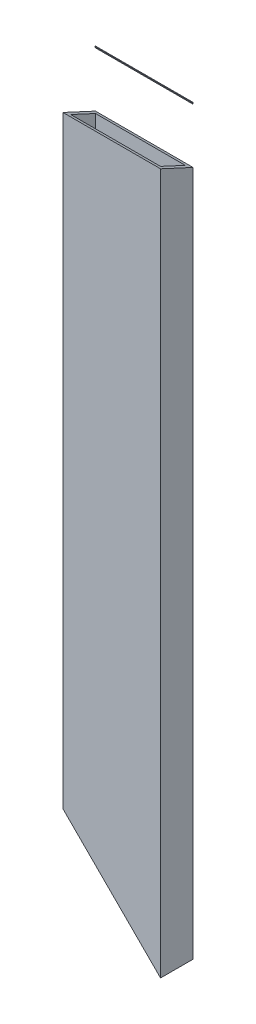
ISO-10303-21;
HEADER;
FILE_DESCRIPTION(('STEP AP214'),'2;1');
FILE_NAME('part.step','',(''),(''),'','','');
FILE_SCHEMA(('AUTOMOTIVE_DESIGN { 1 0 10303 214 1 1 1 1 }'));
ENDSEC;
DATA;
#1=APPLICATION_CONTEXT('core data for automotive mechanical design processes');
#2=APPLICATION_PROTOCOL_DEFINITION('international standard','automotive_design',2000,#1);
#3=PRODUCT_CONTEXT('',#1,'mechanical');
#4=PRODUCT('Part','Part','',(#3));
#5=PRODUCT_RELATED_PRODUCT_CATEGORY('part','',(#4));
#6=PRODUCT_DEFINITION_FORMATION('','',#4);
#7=PRODUCT_DEFINITION_CONTEXT('part definition',#1,'design');
#8=PRODUCT_DEFINITION('design','',#6,#7);
#9=PRODUCT_DEFINITION_SHAPE('','',#8);
#10=(LENGTH_UNIT() NAMED_UNIT(*) SI_UNIT(.MILLI.,.METRE.));
#11=(NAMED_UNIT(*) PLANE_ANGLE_UNIT() SI_UNIT($,.RADIAN.));
#12=(NAMED_UNIT(*) SI_UNIT($,.STERADIAN.) SOLID_ANGLE_UNIT());
#13=UNCERTAINTY_MEASURE_WITH_UNIT(LENGTH_MEASURE(1.E-05),#10,'distance_accuracy_value','');
#14=(GEOMETRIC_REPRESENTATION_CONTEXT(3) GLOBAL_UNCERTAINTY_ASSIGNED_CONTEXT((#13)) GLOBAL_UNIT_ASSIGNED_CONTEXT((#10,
#11,#12)) REPRESENTATION_CONTEXT('',''));
#15=CARTESIAN_POINT('',(0.,0.,0.));
#16=DIRECTION('',(0.,0.,1.));
#17=DIRECTION('',(1.,0.,0.));
#18=AXIS2_PLACEMENT_3D('',#15,#16,#17);
#19=CARTESIAN_POINT('',(-38.1,503.,-12.7));
#20=DIRECTION('',(1.,0.,0.));
#21=DIRECTION('',(0.,0.,-1.));
#22=AXIS2_PLACEMENT_3D('',#19,#20,#21);
#23=PLANE('',#22);
#24=DIRECTION('',(0.,-1.,0.));
#25=VECTOR('',#24,1.);
#26=CARTESIAN_POINT('',(-38.1,503.,12.7));
#27=LINE('',#26,#25);
#28=CARTESIAN_POINT('',(-38.1,508.891605227692,12.7));
#29=VERTEX_POINT('',#28);
#30=CARTESIAN_POINT('',(-38.1,38.1907663481749,12.7));
#31=VERTEX_POINT('',#30);
#32=EDGE_CURVE('E136',#29,#31,#27,.T.);
#33=ORIENTED_EDGE('',*,*,#32,.F.);
#34=DIRECTION('',(0.,-0.420827858242929,-0.907140514874443));
#35=VECTOR('',#34,1.);
#36=CARTESIAN_POINT('',(-38.1,487.450611993712,-33.5184079801674));
#37=LINE('',#36,#35);
#38=CARTESIAN_POINT('',(-38.1,497.108394772308,-12.7));
#39=VERTEX_POINT('',#38);
#40=EDGE_CURVE('E66',#29,#39,#37,.T.);
#41=ORIENTED_EDGE('',*,*,#40,.T.);
#42=DIRECTION('',(0.,-1.,0.));
#43=VECTOR('',#42,1.);
#44=CARTESIAN_POINT('',(-38.1,503.,-12.7));
#45=LINE('',#44,#43);
#46=CARTESIAN_POINT('',(-38.1,38.1907663481749,-12.7));
#47=VERTEX_POINT('',#46);
#48=EDGE_CURVE('E49',#39,#47,#45,.T.);
#49=ORIENTED_EDGE('',*,*,#48,.T.);
#50=DIRECTION('',(0.,0.,1.));
#51=VECTOR('',#50,1.);
#52=CARTESIAN_POINT('',(-38.1,38.1907663481749,-12.6999999999999));
#53=LINE('',#52,#51);
#54=EDGE_CURVE('E137',#47,#31,#53,.T.);
#55=ORIENTED_EDGE('',*,*,#54,.T.);
#56=EDGE_LOOP('',(#33,#41,#49,#55));
#57=FACE_BOUND('',#56,.T.);
#58=ADVANCED_FACE('F46',(#57),#23,.F.);
#59=CARTESIAN_POINT('',(-38.1,503.,12.7));
#60=DIRECTION('',(0.,0.,-1.));
#61=DIRECTION('',(-1.,0.,0.));
#62=AXIS2_PLACEMENT_3D('',#59,#60,#61);
#63=PLANE('',#62);
#64=DIRECTION('',(0.,-1.,0.));
#65=VECTOR('',#64,1.);
#66=CARTESIAN_POINT('',(38.1,503.,12.7));
#67=LINE('',#66,#65);
#68=CARTESIAN_POINT('',(38.1,508.891605227692,12.7));
#69=VERTEX_POINT('',#68);
#70=CARTESIAN_POINT('',(38.1,-38.0954327283679,12.7));
#71=VERTEX_POINT('',#70);
#72=EDGE_CURVE('E152',#69,#71,#67,.T.);
#73=ORIENTED_EDGE('',*,*,#72,.F.);
#74=DIRECTION('',(-1.,0.,0.));
#75=VECTOR('',#74,1.);
#76=CARTESIAN_POINT('',(-38.1,508.891605227692,12.7));
#77=LINE('',#76,#75);
#78=EDGE_CURVE('E61',#69,#29,#77,.T.);
#79=ORIENTED_EDGE('',*,*,#78,.T.);
#80=ORIENTED_EDGE('',*,*,#32,.T.);
#81=DIRECTION('',(-0.706706947168933,0.707506389245473,0.));
#82=VECTOR('',#81,1.);
#83=CARTESIAN_POINT('',(-63.7044254984487,63.8241561226522,12.7));
#84=LINE('',#83,#82);
#85=EDGE_CURVE('E133',#71,#31,#84,.T.);
#86=ORIENTED_EDGE('',*,*,#85,.F.);
#87=EDGE_LOOP('',(#73,#79,#80,#86));
#88=FACE_BOUND('',#87,.T.);
#89=ADVANCED_FACE('F198',(#88),#63,.F.);
#90=CARTESIAN_POINT('',(38.1,503.,-12.7));
#91=DIRECTION('',(-1.,0.,0.));
#92=DIRECTION('',(0.,0.,1.));
#93=AXIS2_PLACEMENT_3D('',#90,#91,#92);
#94=PLANE('',#93);
#95=DIRECTION('',(0.,-1.,0.));
#96=VECTOR('',#95,1.);
#97=CARTESIAN_POINT('',(38.1,503.,-12.7));
#98=LINE('',#97,#96);
#99=CARTESIAN_POINT('',(38.1,497.108394772308,-12.7));
#100=VERTEX_POINT('',#99);
#101=CARTESIAN_POINT('',(38.1,-38.0954327283678,-12.7));
#102=VERTEX_POINT('',#101);
#103=EDGE_CURVE('E116',#100,#102,#98,.T.);
#104=ORIENTED_EDGE('',*,*,#103,.F.);
#105=DIRECTION('',(0.,-0.420827858242929,-0.907140514874443));
#106=VECTOR('',#105,1.);
#107=CARTESIAN_POINT('',(38.1,487.450611993712,-33.5184079801674));
#108=LINE('',#107,#106);
#109=EDGE_CURVE('E12',#69,#100,#108,.T.);
#110=ORIENTED_EDGE('',*,*,#109,.F.);
#111=ORIENTED_EDGE('',*,*,#72,.T.);
#112=DIRECTION('',(0.,0.,-1.));
#113=VECTOR('',#112,1.);
#114=CARTESIAN_POINT('',(38.1,-38.0954327283678,-12.6999999999999));
#115=LINE('',#114,#113);
#116=EDGE_CURVE('E118',#71,#102,#115,.T.);
#117=ORIENTED_EDGE('',*,*,#116,.T.);
#118=EDGE_LOOP('',(#104,#110,#111,#117));
#119=FACE_BOUND('',#118,.T.);
#120=ADVANCED_FACE('F121',(#119),#94,.F.);
#121=CARTESIAN_POINT('',(-38.1,503.,-12.7));
#122=DIRECTION('',(0.,0.,1.));
#123=DIRECTION('',(1.,0.,0.));
#124=AXIS2_PLACEMENT_3D('',#121,#122,#123);
#125=PLANE('',#124);
#126=ORIENTED_EDGE('',*,*,#48,.F.);
#127=DIRECTION('',(1.,0.,0.));
#128=VECTOR('',#127,1.);
#129=CARTESIAN_POINT('',(-38.1,497.108394772308,-12.7));
#130=LINE('',#129,#128);
#131=EDGE_CURVE('E108',#39,#100,#130,.T.);
#132=ORIENTED_EDGE('',*,*,#131,.T.);
#133=ORIENTED_EDGE('',*,*,#103,.T.);
#134=DIRECTION('',(-0.706706947168933,0.707506389245473,0.));
#135=VECTOR('',#134,1.);
#136=CARTESIAN_POINT('',(-63.7044254984487,63.8241561226522,-12.7));
#137=LINE('',#136,#135);
#138=EDGE_CURVE('E123',#102,#47,#137,.T.);
#139=ORIENTED_EDGE('',*,*,#138,.T.);
#140=EDGE_LOOP('',(#126,#132,#133,#139));
#141=FACE_BOUND('',#140,.T.);
#142=ADVANCED_FACE('F114',(#141),#125,.F.);
#143=CARTESIAN_POINT('',(-35.052,503.,-9.65199999999999));
#144=DIRECTION('',(1.,0.,0.));
#145=DIRECTION('',(0.,0.,-1.));
#146=AXIS2_PLACEMENT_3D('',#143,#144,#145);
#147=PLANE('',#146);
#148=DIRECTION('',(0.,-0.420827858242929,-0.907140514874443));
#149=VECTOR('',#148,1.);
#150=CARTESIAN_POINT('',(-35.052,499.315349,-7.94266857528982));
#151=LINE('',#150,#149);
#152=CARTESIAN_POINT('',(-35.052,507.477619973046,9.652));
#153=VERTEX_POINT('',#152);
#154=CARTESIAN_POINT('',(-35.052,498.522380026954,-9.65199999999999));
#155=VERTEX_POINT('',#154);
#156=EDGE_CURVE('E132',#153,#155,#151,.T.);
#157=ORIENTED_EDGE('',*,*,#156,.F.);
#158=DIRECTION('',(0.,-1.,0.));
#159=VECTOR('',#158,1.);
#160=CARTESIAN_POINT('',(-35.052,503.,9.652));
#161=LINE('',#160,#159);
#162=CARTESIAN_POINT('',(-35.052,35.1393183851132,9.652));
#163=VERTEX_POINT('',#162);
#164=EDGE_CURVE('E124',#153,#163,#161,.T.);
#165=ORIENTED_EDGE('',*,*,#164,.T.);
#166=DIRECTION('',(0.,0.,1.));
#167=VECTOR('',#166,1.);
#168=CARTESIAN_POINT('',(-35.052,35.1393183851132,-9.65199999999999));
#169=LINE('',#168,#167);
#170=CARTESIAN_POINT('',(-35.052,35.1393183851132,-9.65199999999999));
#171=VERTEX_POINT('',#170);
#172=EDGE_CURVE('E147',#171,#163,#169,.T.);
#173=ORIENTED_EDGE('',*,*,#172,.F.);
#174=DIRECTION('',(0.,-1.,0.));
#175=VECTOR('',#174,1.);
#176=CARTESIAN_POINT('',(-35.052,503.,-9.65199999999999));
#177=LINE('',#176,#175);
#178=EDGE_CURVE('E150',#155,#171,#177,.T.);
#179=ORIENTED_EDGE('',*,*,#178,.F.);
#180=EDGE_LOOP('',(#157,#165,#173,#179));
#181=FACE_BOUND('',#180,.T.);
#182=ADVANCED_FACE('F185',(#181),#147,.T.);
#183=CARTESIAN_POINT('',(-35.052,503.,9.652));
#184=DIRECTION('',(0.,0.,-1.));
#185=DIRECTION('',(-1.,0.,0.));
#186=AXIS2_PLACEMENT_3D('',#183,#184,#185);
#187=PLANE('',#186);
#188=DIRECTION('',(-1.,0.,0.));
#189=VECTOR('',#188,1.);
#190=CARTESIAN_POINT('',(-35.052,507.477619973046,9.652));
#191=LINE('',#190,#189);
#192=CARTESIAN_POINT('',(35.052,507.477619973046,9.65199999999999));
#193=VERTEX_POINT('',#192);
#194=EDGE_CURVE('E54',#193,#153,#191,.T.);
#195=ORIENTED_EDGE('',*,*,#194,.F.);
#196=DIRECTION('',(0.,-1.,0.));
#197=VECTOR('',#196,1.);
#198=CARTESIAN_POINT('',(35.052,503.,9.65199999999999));
#199=LINE('',#198,#197);
#200=CARTESIAN_POINT('',(35.052,-35.0439847653061,9.65199999999999));
#201=VERTEX_POINT('',#200);
#202=EDGE_CURVE('E158',#193,#201,#199,.T.);
#203=ORIENTED_EDGE('',*,*,#202,.T.);
#204=DIRECTION('',(0.706706947168933,-0.707506389245473,0.));
#205=VECTOR('',#204,1.);
#206=CARTESIAN_POINT('',(-268.982191300777,269.334136542394,9.65200000000003));
#207=LINE('',#206,#205);
#208=EDGE_CURVE('E144',#163,#201,#207,.T.);
#209=ORIENTED_EDGE('',*,*,#208,.F.);
#210=ORIENTED_EDGE('',*,*,#164,.F.);
#211=EDGE_LOOP('',(#195,#203,#209,#210));
#212=FACE_BOUND('',#211,.T.);
#213=ADVANCED_FACE('F188',(#212),#187,.T.);
#214=CARTESIAN_POINT('',(35.052,503.,-9.652));
#215=DIRECTION('',(-1.,0.,0.));
#216=DIRECTION('',(0.,0.,1.));
#217=AXIS2_PLACEMENT_3D('',#214,#215,#216);
#218=PLANE('',#217);
#219=DIRECTION('',(0.,0.420827858242929,0.907140514874443));
#220=VECTOR('',#219,1.);
#221=CARTESIAN_POINT('',(35.052,499.315349,-7.94266857528982));
#222=LINE('',#221,#220);
#223=CARTESIAN_POINT('',(35.052,498.522380026954,-9.652));
#224=VERTEX_POINT('',#223);
#225=EDGE_CURVE('E128',#224,#193,#222,.T.);
#226=ORIENTED_EDGE('',*,*,#225,.F.);
#227=DIRECTION('',(0.,-1.,0.));
#228=VECTOR('',#227,1.);
#229=CARTESIAN_POINT('',(35.052,503.,-9.652));
#230=LINE('',#229,#228);
#231=CARTESIAN_POINT('',(35.052,-35.0439847653061,-9.652));
#232=VERTEX_POINT('',#231);
#233=EDGE_CURVE('E156',#224,#232,#230,.T.);
#234=ORIENTED_EDGE('',*,*,#233,.T.);
#235=DIRECTION('',(0.,0.,-1.));
#236=VECTOR('',#235,1.);
#237=CARTESIAN_POINT('',(35.052,-35.0439847653061,-9.652));
#238=LINE('',#237,#236);
#239=EDGE_CURVE('E141',#201,#232,#238,.T.);
#240=ORIENTED_EDGE('',*,*,#239,.F.);
#241=ORIENTED_EDGE('',*,*,#202,.F.);
#242=EDGE_LOOP('',(#226,#234,#240,#241));
#243=FACE_BOUND('',#242,.T.);
#244=ADVANCED_FACE('F175',(#243),#218,.T.);
#245=CARTESIAN_POINT('',(-35.052,503.,-9.65199999999999));
#246=DIRECTION('',(0.,0.,1.));
#247=DIRECTION('',(1.,0.,0.));
#248=AXIS2_PLACEMENT_3D('',#245,#246,#247);
#249=PLANE('',#248);
#250=DIRECTION('',(1.,0.,0.));
#251=VECTOR('',#250,1.);
#252=CARTESIAN_POINT('',(-35.052,498.522380026954,-9.65199999999999));
#253=LINE('',#252,#251);
#254=EDGE_CURVE('E130',#155,#224,#253,.T.);
#255=ORIENTED_EDGE('',*,*,#254,.F.);
#256=ORIENTED_EDGE('',*,*,#178,.T.);
#257=DIRECTION('',(-0.706706947168933,0.707506389245473,0.));
#258=VECTOR('',#257,1.);
#259=CARTESIAN_POINT('',(-268.982191300777,269.334136542394,-9.65199999999996));
#260=LINE('',#259,#258);
#261=EDGE_CURVE('E139',#232,#171,#260,.T.);
#262=ORIENTED_EDGE('',*,*,#261,.F.);
#263=ORIENTED_EDGE('',*,*,#233,.F.);
#264=EDGE_LOOP('',(#255,#256,#262,#263));
#265=FACE_BOUND('',#264,.T.);
#266=ADVANCED_FACE('F178',(#265),#249,.T.);
#267=CARTESIAN_POINT('',(-63.7044254984487,63.8241561226522,-12.7));
#268=DIRECTION('',(0.707506389245473,0.706706947168933,0.));
#269=DIRECTION('',(-0.706706947168933,0.707506389245473,0.));
#270=AXIS2_PLACEMENT_3D('',#267,#268,#269);
#271=PLANE('',#270);
#272=ORIENTED_EDGE('',*,*,#172,.T.);
#273=ORIENTED_EDGE('',*,*,#208,.T.);
#274=ORIENTED_EDGE('',*,*,#239,.T.);
#275=ORIENTED_EDGE('',*,*,#261,.T.);
#276=EDGE_LOOP('',(#272,#273,#274,#275));
#277=FACE_BOUND('',#276,.T.);
#278=ORIENTED_EDGE('',*,*,#138,.F.);
#279=ORIENTED_EDGE('',*,*,#116,.F.);
#280=ORIENTED_EDGE('',*,*,#85,.T.);
#281=ORIENTED_EDGE('',*,*,#54,.F.);
#282=EDGE_LOOP('',(#278,#279,#280,#281));
#283=FACE_BOUND('',#282,.T.);
#284=ADVANCED_FACE('F181',(#277,#283),#271,.F.);
#285=CARTESIAN_POINT('',(-38.1,487.450611993712,-33.5184079801674));
#286=DIRECTION('',(0.,-0.907140514874443,0.420827858242929));
#287=DIRECTION('',(0.,-0.420827858242929,-0.907140514874443));
#288=AXIS2_PLACEMENT_3D('',#285,#286,#287);
#289=PLANE('',#288);
#290=ORIENTED_EDGE('',*,*,#156,.T.);
#291=ORIENTED_EDGE('',*,*,#254,.T.);
#292=ORIENTED_EDGE('',*,*,#225,.T.);
#293=ORIENTED_EDGE('',*,*,#194,.T.);
#294=EDGE_LOOP('',(#290,#291,#292,#293));
#295=FACE_BOUND('',#294,.T.);
#296=ORIENTED_EDGE('',*,*,#109,.T.);
#297=ORIENTED_EDGE('',*,*,#131,.F.);
#298=ORIENTED_EDGE('',*,*,#40,.F.);
#299=ORIENTED_EDGE('',*,*,#78,.F.);
#300=EDGE_LOOP('',(#296,#297,#298,#299));
#301=FACE_BOUND('',#300,.T.);
#302=ADVANCED_FACE('F107',(#295,#301),#289,.F.);
#303=CLOSED_SHELL('',(#58,#89,#120,#142,#182,#213,#244,#266,#284,#302));
#304=MANIFOLD_SOLID_BREP('B2',#303);
#305=CARTESIAN_POINT('',(0.,541.1,0.));
#306=DIRECTION('',(0.,1.,0.));
#307=DIRECTION('',(0.,0.,1.));
#308=AXIS2_PLACEMENT_3D('',#305,#306,#307);
#309=PLANE('',#308);
#310=DIRECTION('',(-1.,0.,0.));
#311=VECTOR('',#310,1.);
#312=CARTESIAN_POINT('',(0.,541.1,-12.1921981623207));
#313=LINE('',#312,#311);
#314=CARTESIAN_POINT('',(38.1,541.1,-12.1921981623207));
#315=VERTEX_POINT('',#314);
#316=CARTESIAN_POINT('',(-38.1,541.1,-12.1921981623207));
#317=VERTEX_POINT('',#316);
#318=EDGE_CURVE('E44',#315,#317,#313,.T.);
#319=ORIENTED_EDGE('',*,*,#318,.F.);
#320=DIRECTION('',(0.,0.,-1.));
#321=VECTOR('',#320,1.);
#322=CARTESIAN_POINT('',(38.1,541.1,12.7));
#323=LINE('',#322,#321);
#324=CARTESIAN_POINT('',(38.1,541.1,-12.7));
#325=VERTEX_POINT('',#324);
#326=EDGE_CURVE('E344',#315,#325,#323,.T.);
#327=ORIENTED_EDGE('',*,*,#326,.T.);
#328=DIRECTION('',(-1.,0.,0.));
#329=VECTOR('',#328,1.);
#330=CARTESIAN_POINT('',(38.1,541.1,-12.7));
#331=LINE('',#330,#329);
#332=CARTESIAN_POINT('',(-38.1,541.1,-12.7));
#333=VERTEX_POINT('',#332);
#334=EDGE_CURVE('E363',#325,#333,#331,.T.);
#335=ORIENTED_EDGE('',*,*,#334,.T.);
#336=DIRECTION('',(0.,0.,1.));
#337=VECTOR('',#336,1.);
#338=CARTESIAN_POINT('',(-38.1,541.1,-12.7));
#339=LINE('',#338,#337);
#340=EDGE_CURVE('E374',#333,#317,#339,.T.);
#341=ORIENTED_EDGE('',*,*,#340,.T.);
#342=EDGE_LOOP('',(#319,#327,#335,#341));
#343=FACE_BOUND('',#342,.T.);
#344=ADVANCED_FACE('F323',(#343),#309,.T.);
#345=CARTESIAN_POINT('',(-38.1,503.,-12.7));
#346=DIRECTION('',(0.,0.,1.));
#347=DIRECTION('',(1.,0.,0.));
#348=AXIS2_PLACEMENT_3D('',#345,#346,#347);
#349=PLANE('',#348);
#350=DIRECTION('',(0.,-1.,0.));
#351=VECTOR('',#350,1.);
#352=CARTESIAN_POINT('',(38.1,503.,-12.7));
#353=LINE('',#352,#351);
#354=CARTESIAN_POINT('',(38.1,539.822545728817,-12.7));
#355=VERTEX_POINT('',#354);
#356=EDGE_CURVE('E331',#325,#355,#353,.T.);
#357=ORIENTED_EDGE('',*,*,#356,.T.);
#358=DIRECTION('',(-1.,0.,0.));
#359=VECTOR('',#358,1.);
#360=CARTESIAN_POINT('',(-38.1,539.822545728817,-12.7));
#361=LINE('',#360,#359);
#362=CARTESIAN_POINT('',(-38.1,539.822545728817,-12.7));
#363=VERTEX_POINT('',#362);
#364=EDGE_CURVE('E356',#355,#363,#361,.T.);
#365=ORIENTED_EDGE('',*,*,#364,.T.);
#366=DIRECTION('',(0.,-1.,0.));
#367=VECTOR('',#366,1.);
#368=CARTESIAN_POINT('',(-38.1,503.,-12.7));
#369=LINE('',#368,#367);
#370=EDGE_CURVE('E370',#333,#363,#369,.T.);
#371=ORIENTED_EDGE('',*,*,#370,.F.);
#372=ORIENTED_EDGE('',*,*,#334,.F.);
#373=EDGE_LOOP('',(#357,#365,#371,#372));
#374=FACE_BOUND('',#373,.T.);
#375=ADVANCED_FACE('F369',(#374),#349,.F.);
#376=CARTESIAN_POINT('',(38.1,503.,-12.7));
#377=DIRECTION('',(-1.,0.,0.));
#378=DIRECTION('',(0.,0.,1.));
#379=AXIS2_PLACEMENT_3D('',#376,#377,#378);
#380=PLANE('',#379);
#381=ORIENTED_EDGE('',*,*,#326,.F.);
#382=DIRECTION('',(0.,0.929272193398902,0.36939571001244));
#383=VECTOR('',#382,1.);
#384=CARTESIAN_POINT('',(38.1,545.017601807482,-10.6349092307236));
#385=LINE('',#384,#383);
#386=EDGE_CURVE('E337',#355,#315,#385,.T.);
#387=ORIENTED_EDGE('',*,*,#386,.F.);
#388=ORIENTED_EDGE('',*,*,#356,.F.);
#389=EDGE_LOOP('',(#381,#387,#388));
#390=FACE_BOUND('',#389,.T.);
#391=ADVANCED_FACE('F366',(#390),#380,.F.);
#392=CARTESIAN_POINT('',(-38.1,503.,-12.7));
#393=DIRECTION('',(1.,0.,0.));
#394=DIRECTION('',(0.,0.,-1.));
#395=AXIS2_PLACEMENT_3D('',#392,#393,#394);
#396=PLANE('',#395);
#397=ORIENTED_EDGE('',*,*,#370,.T.);
#398=DIRECTION('',(0.,0.929272193398902,0.36939571001244));
#399=VECTOR('',#398,1.);
#400=CARTESIAN_POINT('',(-38.1,545.017601807482,-10.6349092307237));
#401=LINE('',#400,#399);
#402=EDGE_CURVE('E359',#363,#317,#401,.T.);
#403=ORIENTED_EDGE('',*,*,#402,.T.);
#404=ORIENTED_EDGE('',*,*,#340,.F.);
#405=EDGE_LOOP('',(#397,#403,#404));
#406=FACE_BOUND('',#405,.T.);
#407=ADVANCED_FACE('F325',(#406),#396,.F.);
#408=CARTESIAN_POINT('',(-38.1,545.017601807482,-10.6349092307237));
#409=DIRECTION('',(0.,0.36939571001244,-0.929272193398902));
#410=DIRECTION('',(0.,0.929272193398902,0.36939571001244));
#411=AXIS2_PLACEMENT_3D('',#408,#409,#410);
#412=PLANE('',#411);
#413=ORIENTED_EDGE('',*,*,#386,.T.);
#414=ORIENTED_EDGE('',*,*,#318,.T.);
#415=ORIENTED_EDGE('',*,*,#402,.F.);
#416=ORIENTED_EDGE('',*,*,#364,.F.);
#417=EDGE_LOOP('',(#413,#414,#415,#416));
#418=FACE_BOUND('',#417,.T.);
#419=ADVANCED_FACE('F357',(#418),#412,.F.);
#420=CLOSED_SHELL('',(#344,#375,#391,#407,#419));
#421=MANIFOLD_SOLID_BREP('B6',#420);
#422=ADVANCED_BREP_SHAPE_REPRESENTATION('',(#18,#304,#421),#14);
#423=SHAPE_DEFINITION_REPRESENTATION(#9,#422);
ENDSEC;
END-ISO-10303-21;
